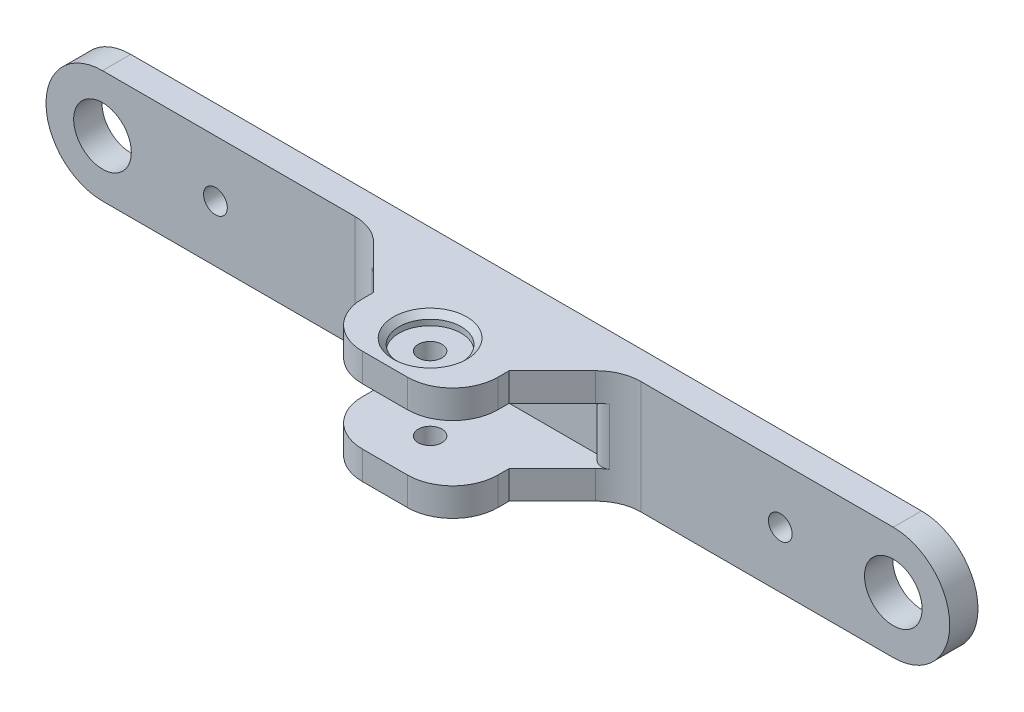
ISO-10303-21;
HEADER;
FILE_DESCRIPTION(('STEP AP214'),'2;1');
FILE_NAME('part.step','',(''),(''),'','','');
FILE_SCHEMA(('AUTOMOTIVE_DESIGN { 1 0 10303 214 1 1 1 1 }'));
ENDSEC;
DATA;
#1=APPLICATION_CONTEXT('core data for automotive mechanical design processes');
#2=APPLICATION_PROTOCOL_DEFINITION('international standard','automotive_design',2000,#1);
#3=PRODUCT_CONTEXT('',#1,'mechanical');
#4=PRODUCT('Part','Part','',(#3));
#5=PRODUCT_RELATED_PRODUCT_CATEGORY('part','',(#4));
#6=PRODUCT_DEFINITION_FORMATION('','',#4);
#7=PRODUCT_DEFINITION_CONTEXT('part definition',#1,'design');
#8=PRODUCT_DEFINITION('design','',#6,#7);
#9=PRODUCT_DEFINITION_SHAPE('','',#8);
#10=(LENGTH_UNIT() NAMED_UNIT(*) SI_UNIT(.MILLI.,.METRE.));
#11=(NAMED_UNIT(*) PLANE_ANGLE_UNIT() SI_UNIT($,.RADIAN.));
#12=(NAMED_UNIT(*) SI_UNIT($,.STERADIAN.) SOLID_ANGLE_UNIT());
#13=UNCERTAINTY_MEASURE_WITH_UNIT(LENGTH_MEASURE(1.E-05),#10,'distance_accuracy_value','');
#14=(GEOMETRIC_REPRESENTATION_CONTEXT(3) GLOBAL_UNCERTAINTY_ASSIGNED_CONTEXT((#13)) GLOBAL_UNIT_ASSIGNED_CONTEXT((#10,
#11,#12)) REPRESENTATION_CONTEXT('',''));
#15=CARTESIAN_POINT('',(0.,0.,0.));
#16=DIRECTION('',(0.,0.,1.));
#17=DIRECTION('',(1.,0.,0.));
#18=AXIS2_PLACEMENT_3D('',#15,#16,#17);
#19=CARTESIAN_POINT('',(-12.,10.,15.0000000000001));
#20=DIRECTION('',(0.707106781186551,0.,-0.707106781186544));
#21=DIRECTION('',(0.,-1.,0.));
#22=AXIS2_PLACEMENT_3D('',#19,#20,#21);
#23=PLANE('',#22);
#24=DIRECTION('',(0.,1.,0.));
#25=VECTOR('',#24,1.);
#26=CARTESIAN_POINT('',(-19.6568542494923,10.,7.34314575050765));
#27=LINE('',#26,#25);
#28=CARTESIAN_POINT('',(-19.6568542494923,10.,7.34314575050765));
#29=VERTEX_POINT('',#28);
#30=CARTESIAN_POINT('',(-19.6568542494923,5.,7.34314575050765));
#31=VERTEX_POINT('',#30);
#32=EDGE_CURVE('E254',#29,#31,#27,.F.);
#33=ORIENTED_EDGE('',*,*,#32,.T.);
#34=DIRECTION('',(0.707106781186544,0.,0.707106781186551));
#35=VECTOR('',#34,1.);
#36=CARTESIAN_POINT('',(-12.,5.,15.0000000000001));
#37=LINE('',#36,#35);
#38=CARTESIAN_POINT('',(-12.,5.,15.0000000000001));
#39=VERTEX_POINT('',#38);
#40=EDGE_CURVE('E250',#31,#39,#37,.T.);
#41=ORIENTED_EDGE('',*,*,#40,.T.);
#42=DIRECTION('',(0.,-1.,0.));
#43=VECTOR('',#42,1.);
#44=CARTESIAN_POINT('',(-12.,10.,15.0000000000001));
#45=LINE('',#44,#43);
#46=CARTESIAN_POINT('',(-12.,10.,15.0000000000001));
#47=VERTEX_POINT('',#46);
#48=EDGE_CURVE('E324',#47,#39,#45,.T.);
#49=ORIENTED_EDGE('',*,*,#48,.F.);
#50=DIRECTION('',(0.707106781186544,0.,0.707106781186551));
#51=VECTOR('',#50,1.);
#52=CARTESIAN_POINT('',(-45.9999999999997,10.,-19.));
#53=LINE('',#52,#51);
#54=EDGE_CURVE('E260',#29,#47,#53,.T.);
#55=ORIENTED_EDGE('',*,*,#54,.F.);
#56=EDGE_LOOP('',(#33,#41,#49,#55));
#57=FACE_BOUND('',#56,.T.);
#58=ADVANCED_FACE('F35',(#57),#23,.F.);
#59=CARTESIAN_POINT('',(12.,10.,15.0000000000001));
#60=DIRECTION('',(-0.707106781186551,0.,-0.707106781186544));
#61=DIRECTION('',(0.,1.,0.));
#62=AXIS2_PLACEMENT_3D('',#59,#60,#61);
#63=PLANE('',#62);
#64=DIRECTION('',(0.,-1.,0.));
#65=VECTOR('',#64,1.);
#66=CARTESIAN_POINT('',(19.6568542494923,10.,7.34314575050766));
#67=LINE('',#66,#65);
#68=CARTESIAN_POINT('',(19.6568542494923,-10.,7.34314575050765));
#69=VERTEX_POINT('',#68);
#70=CARTESIAN_POINT('',(19.6568542494923,-5.,7.34314575050766));
#71=VERTEX_POINT('',#70);
#72=EDGE_CURVE('E379',#69,#71,#67,.F.);
#73=ORIENTED_EDGE('',*,*,#72,.T.);
#74=DIRECTION('',(-0.707106781186544,0.,0.707106781186551));
#75=VECTOR('',#74,1.);
#76=CARTESIAN_POINT('',(12.,-5.,15.0000000000001));
#77=LINE('',#76,#75);
#78=CARTESIAN_POINT('',(12.,-5.,15.0000000000001));
#79=VERTEX_POINT('',#78);
#80=EDGE_CURVE('E386',#71,#79,#77,.T.);
#81=ORIENTED_EDGE('',*,*,#80,.T.);
#82=DIRECTION('',(0.,1.,0.));
#83=VECTOR('',#82,1.);
#84=CARTESIAN_POINT('',(12.,10.,15.0000000000001));
#85=LINE('',#84,#83);
#86=CARTESIAN_POINT('',(12.,-10.,15.0000000000001));
#87=VERTEX_POINT('',#86);
#88=EDGE_CURVE('E327',#87,#79,#85,.T.);
#89=ORIENTED_EDGE('',*,*,#88,.F.);
#90=DIRECTION('',(-0.707106781186544,0.,0.707106781186551));
#91=VECTOR('',#90,1.);
#92=CARTESIAN_POINT('',(-23.9999999999995,-10.,51.));
#93=LINE('',#92,#91);
#94=EDGE_CURVE('E318',#69,#87,#93,.T.);
#95=ORIENTED_EDGE('',*,*,#94,.F.);
#96=EDGE_LOOP('',(#73,#81,#89,#95));
#97=FACE_BOUND('',#96,.T.);
#98=ADVANCED_FACE('F384',(#97),#63,.F.);
#99=CARTESIAN_POINT('',(0.,-10.,17.));
#100=DIRECTION('',(0.,1.,0.));
#101=DIRECTION('',(0.,0.,1.));
#102=AXIS2_PLACEMENT_3D('',#99,#100,#101);
#103=CYLINDRICAL_SURFACE('',#102,2.1);
#104=CARTESIAN_POINT('',(0.,5.,17.));
#105=DIRECTION('',(0.,1.,0.));
#106=DIRECTION('',(0.,0.,1.));
#107=AXIS2_PLACEMENT_3D('',#104,#105,#106);
#108=CIRCLE('',#107,2.1);
#109=CARTESIAN_POINT('',(0.,5.,19.1));
#110=VERTEX_POINT('',#109);
#111=EDGE_CURVE('E310',#110,#110,#108,.T.);
#112=ORIENTED_EDGE('',*,*,#111,.F.);
#113=EDGE_LOOP('',(#112));
#114=FACE_BOUND('',#113,.T.);
#115=CARTESIAN_POINT('',(0.,8.,17.));
#116=DIRECTION('',(0.,1.,0.));
#117=DIRECTION('',(0.,0.,1.));
#118=AXIS2_PLACEMENT_3D('',#115,#116,#117);
#119=CIRCLE('',#118,2.1);
#120=CARTESIAN_POINT('',(0.,8.,19.1));
#121=VERTEX_POINT('',#120);
#122=EDGE_CURVE('E360',#121,#121,#119,.F.);
#123=ORIENTED_EDGE('',*,*,#122,.F.);
#124=EDGE_LOOP('',(#123));
#125=FACE_BOUND('',#124,.T.);
#126=ADVANCED_FACE('F486',(#114,#125),#103,.F.);
#127=CARTESIAN_POINT('',(-12.,10.,25.));
#128=DIRECTION('',(1.,0.,0.));
#129=DIRECTION('',(0.,1.,0.));
#130=AXIS2_PLACEMENT_3D('',#127,#128,#129);
#131=PLANE('',#130);
#132=DIRECTION('',(0.,0.,1.));
#133=VECTOR('',#132,1.);
#134=CARTESIAN_POINT('',(-12.,5.,25.));
#135=LINE('',#134,#133);
#136=CARTESIAN_POINT('',(-12.,5.,17.));
#137=VERTEX_POINT('',#136);
#138=EDGE_CURVE('E403',#39,#137,#135,.T.);
#139=ORIENTED_EDGE('',*,*,#138,.T.);
#140=DIRECTION('',(0.,-1.,0.));
#141=VECTOR('',#140,1.);
#142=CARTESIAN_POINT('',(-12.,10.,17.));
#143=LINE('',#142,#141);
#144=CARTESIAN_POINT('',(-12.,10.,17.));
#145=VERTEX_POINT('',#144);
#146=EDGE_CURVE('E342',#137,#145,#143,.F.);
#147=ORIENTED_EDGE('',*,*,#146,.T.);
#148=DIRECTION('',(0.,0.,-1.));
#149=VECTOR('',#148,1.);
#150=CARTESIAN_POINT('',(-12.,10.,25.));
#151=LINE('',#150,#149);
#152=EDGE_CURVE('E335',#145,#47,#151,.T.);
#153=ORIENTED_EDGE('',*,*,#152,.T.);
#154=ORIENTED_EDGE('',*,*,#48,.T.);
#155=EDGE_LOOP('',(#139,#147,#153,#154));
#156=FACE_BOUND('',#155,.T.);
#157=ADVANCED_FACE('F408',(#156),#131,.F.);
#158=CARTESIAN_POINT('',(12.,10.,25.));
#159=DIRECTION('',(-1.,0.,0.));
#160=DIRECTION('',(0.,-1.,0.));
#161=AXIS2_PLACEMENT_3D('',#158,#159,#160);
#162=PLANE('',#161);
#163=DIRECTION('',(0.,0.,-1.));
#164=VECTOR('',#163,1.);
#165=CARTESIAN_POINT('',(12.,10.,25.));
#166=LINE('',#165,#164);
#167=CARTESIAN_POINT('',(12.,10.,17.));
#168=VERTEX_POINT('',#167);
#169=CARTESIAN_POINT('',(12.,10.,15.0000000000001));
#170=VERTEX_POINT('',#169);
#171=EDGE_CURVE('E338',#168,#170,#166,.T.);
#172=ORIENTED_EDGE('',*,*,#171,.F.);
#173=DIRECTION('',(0.,1.,0.));
#174=VECTOR('',#173,1.);
#175=CARTESIAN_POINT('',(12.,5.,17.));
#176=LINE('',#175,#174);
#177=CARTESIAN_POINT('',(12.,5.,17.));
#178=VERTEX_POINT('',#177);
#179=EDGE_CURVE('E349',#168,#178,#176,.F.);
#180=ORIENTED_EDGE('',*,*,#179,.T.);
#181=DIRECTION('',(0.,0.,-1.));
#182=VECTOR('',#181,1.);
#183=CARTESIAN_POINT('',(12.,5.,25.));
#184=LINE('',#183,#182);
#185=CARTESIAN_POINT('',(12.,5.,15.0000000000001));
#186=VERTEX_POINT('',#185);
#187=EDGE_CURVE('E424',#178,#186,#184,.T.);
#188=ORIENTED_EDGE('',*,*,#187,.T.);
#189=EDGE_CURVE('E330',#186,#170,#85,.T.);
#190=ORIENTED_EDGE('',*,*,#189,.T.);
#191=EDGE_LOOP('',(#172,#180,#188,#190));
#192=FACE_BOUND('',#191,.T.);
#193=ADVANCED_FACE('F557',(#192),#162,.F.);
#194=CARTESIAN_POINT('',(0.,0.,25.));
#195=DIRECTION('',(0.,0.,1.));
#196=DIRECTION('',(1.,0.,0.));
#197=AXIS2_PLACEMENT_3D('',#194,#195,#196);
#198=PLANE('',#197);
#199=DIRECTION('',(-1.,0.,0.));
#200=VECTOR('',#199,1.);
#201=CARTESIAN_POINT('',(-12.,10.,25.));
#202=LINE('',#201,#200);
#203=CARTESIAN_POINT('',(4.,10.,25.));
#204=VERTEX_POINT('',#203);
#205=CARTESIAN_POINT('',(-4.,10.,25.));
#206=VERTEX_POINT('',#205);
#207=EDGE_CURVE('E339',#204,#206,#202,.T.);
#208=ORIENTED_EDGE('',*,*,#207,.T.);
#209=DIRECTION('',(0.,-1.,0.));
#210=VECTOR('',#209,1.);
#211=CARTESIAN_POINT('',(-4.,5.,25.));
#212=LINE('',#211,#210);
#213=CARTESIAN_POINT('',(-4.,5.,25.));
#214=VERTEX_POINT('',#213);
#215=EDGE_CURVE('E391',#206,#214,#212,.T.);
#216=ORIENTED_EDGE('',*,*,#215,.T.);
#217=DIRECTION('',(-1.,0.,0.));
#218=VECTOR('',#217,1.);
#219=CARTESIAN_POINT('',(-18.,5.,25.));
#220=LINE('',#219,#218);
#221=CARTESIAN_POINT('',(4.,5.,25.));
#222=VERTEX_POINT('',#221);
#223=EDGE_CURVE('E227',#222,#214,#220,.T.);
#224=ORIENTED_EDGE('',*,*,#223,.F.);
#225=DIRECTION('',(0.,1.,0.));
#226=VECTOR('',#225,1.);
#227=CARTESIAN_POINT('',(4.,10.,25.));
#228=LINE('',#227,#226);
#229=EDGE_CURVE('E387',#222,#204,#228,.T.);
#230=ORIENTED_EDGE('',*,*,#229,.T.);
#231=EDGE_LOOP('',(#208,#216,#224,#230));
#232=FACE_BOUND('',#231,.T.);
#233=ADVANCED_FACE('F419',(#232),#198,.T.);
#234=CARTESIAN_POINT('',(-70.,0.,5.));
#235=DIRECTION('',(0.,0.,1.));
#236=DIRECTION('',(1.,0.,0.));
#237=AXIS2_PLACEMENT_3D('',#234,#235,#236);
#238=PLANE('',#237);
#239=DIRECTION('',(1.,0.,0.));
#240=VECTOR('',#239,1.);
#241=CARTESIAN_POINT('',(-70.,-10.,5.));
#242=LINE('',#241,#240);
#243=CARTESIAN_POINT('',(-70.,-10.,5.));
#244=VERTEX_POINT('',#243);
#245=CARTESIAN_POINT('',(-25.3137084989848,-10.,5.));
#246=VERTEX_POINT('',#245);
#247=EDGE_CURVE('E277',#244,#246,#242,.T.);
#248=ORIENTED_EDGE('',*,*,#247,.T.);
#249=DIRECTION('',(0.,1.,0.));
#250=VECTOR('',#249,1.);
#251=CARTESIAN_POINT('',(-25.3137084989848,0.,5.));
#252=LINE('',#251,#250);
#253=CARTESIAN_POINT('',(-25.3137084989848,10.,5.));
#254=VERTEX_POINT('',#253);
#255=EDGE_CURVE('E267',#246,#254,#252,.T.);
#256=ORIENTED_EDGE('',*,*,#255,.T.);
#257=DIRECTION('',(-1.,0.,0.));
#258=VECTOR('',#257,1.);
#259=CARTESIAN_POINT('',(-70.,10.,5.));
#260=LINE('',#259,#258);
#261=CARTESIAN_POINT('',(-70.,10.,5.));
#262=VERTEX_POINT('',#261);
#263=EDGE_CURVE('E299',#254,#262,#260,.T.);
#264=ORIENTED_EDGE('',*,*,#263,.T.);
#265=CARTESIAN_POINT('',(-70.,0.,5.));
#266=DIRECTION('',(0.,0.,1.));
#267=DIRECTION('',(1.,0.,0.));
#268=AXIS2_PLACEMENT_3D('',#265,#266,#267);
#269=CIRCLE('',#268,10.);
#270=EDGE_CURVE('E278',#262,#244,#269,.T.);
#271=ORIENTED_EDGE('',*,*,#270,.T.);
#272=EDGE_LOOP('',(#248,#256,#264,#271));
#273=FACE_BOUND('',#272,.T.);
#274=CARTESIAN_POINT('',(-70.,0.,5.));
#275=DIRECTION('',(0.,0.,1.));
#276=DIRECTION('',(1.,0.,0.));
#277=AXIS2_PLACEMENT_3D('',#274,#275,#276);
#278=CIRCLE('',#277,5.1);
#279=CARTESIAN_POINT('',(-64.9,0.,5.));
#280=VERTEX_POINT('',#279);
#281=EDGE_CURVE('E445',#280,#280,#278,.T.);
#282=ORIENTED_EDGE('',*,*,#281,.F.);
#283=EDGE_LOOP('',(#282));
#284=FACE_BOUND('',#283,.T.);
#285=CARTESIAN_POINT('',(-50.,0.,5.));
#286=DIRECTION('',(0.,0.,1.));
#287=DIRECTION('',(1.,0.,0.));
#288=AXIS2_PLACEMENT_3D('',#285,#286,#287);
#289=CIRCLE('',#288,2.1);
#290=CARTESIAN_POINT('',(-47.9,0.,5.));
#291=VERTEX_POINT('',#290);
#292=EDGE_CURVE('E431',#291,#291,#289,.T.);
#293=ORIENTED_EDGE('',*,*,#292,.F.);
#294=EDGE_LOOP('',(#293));
#295=FACE_BOUND('',#294,.T.);
#296=ADVANCED_FACE('F455',(#273,#284,#295),#238,.T.);
#297=CARTESIAN_POINT('',(-70.,0.,5.));
#298=DIRECTION('',(0.,0.,-1.));
#299=DIRECTION('',(-1.,0.,0.));
#300=AXIS2_PLACEMENT_3D('',#297,#298,#299);
#301=CYLINDRICAL_SURFACE('',#300,10.);
#302=CARTESIAN_POINT('',(-70.,0.,0.));
#303=DIRECTION('',(0.,0.,1.));
#304=DIRECTION('',(1.,0.,0.));
#305=AXIS2_PLACEMENT_3D('',#302,#303,#304);
#306=CIRCLE('',#305,10.);
#307=CARTESIAN_POINT('',(-70.,10.,0.));
#308=VERTEX_POINT('',#307);
#309=CARTESIAN_POINT('',(-70.,-10.,0.));
#310=VERTEX_POINT('',#309);
#311=EDGE_CURVE('E303',#308,#310,#306,.T.);
#312=ORIENTED_EDGE('',*,*,#311,.T.);
#313=DIRECTION('',(0.,0.,-1.));
#314=VECTOR('',#313,1.);
#315=CARTESIAN_POINT('',(-70.,-10.,5.));
#316=LINE('',#315,#314);
#317=EDGE_CURVE('E293',#244,#310,#316,.T.);
#318=ORIENTED_EDGE('',*,*,#317,.F.);
#319=ORIENTED_EDGE('',*,*,#270,.F.);
#320=DIRECTION('',(0.,0.,-1.));
#321=VECTOR('',#320,1.);
#322=CARTESIAN_POINT('',(-70.,10.,5.));
#323=LINE('',#322,#321);
#324=EDGE_CURVE('E298',#262,#308,#323,.T.);
#325=ORIENTED_EDGE('',*,*,#324,.T.);
#326=EDGE_LOOP('',(#312,#318,#319,#325));
#327=FACE_BOUND('',#326,.T.);
#328=ADVANCED_FACE('F458',(#327),#301,.T.);
#329=CARTESIAN_POINT('',(-70.,-10.,5.));
#330=DIRECTION('',(0.,1.,0.));
#331=DIRECTION('',(0.,0.,1.));
#332=AXIS2_PLACEMENT_3D('',#329,#330,#331);
#333=PLANE('',#332);
#334=CARTESIAN_POINT('',(0.,-10.,17.));
#335=DIRECTION('',(0.,1.,0.));
#336=DIRECTION('',(0.,0.,1.));
#337=AXIS2_PLACEMENT_3D('',#334,#335,#336);
#338=CIRCLE('',#337,2.1);
#339=CARTESIAN_POINT('',(0.,-10.,19.1));
#340=VERTEX_POINT('',#339);
#341=EDGE_CURVE('E311',#340,#340,#338,.T.);
#342=ORIENTED_EDGE('',*,*,#341,.T.);
#343=EDGE_LOOP('',(#342));
#344=FACE_BOUND('',#343,.T.);
#345=DIRECTION('',(1.,0.,0.));
#346=VECTOR('',#345,1.);
#347=CARTESIAN_POINT('',(-12.,-10.,25.));
#348=LINE('',#347,#346);
#349=CARTESIAN_POINT('',(-4.,-10.,25.));
#350=VERTEX_POINT('',#349);
#351=CARTESIAN_POINT('',(4.00000000000001,-10.,25.));
#352=VERTEX_POINT('',#351);
#353=EDGE_CURVE('E421',#350,#352,#348,.T.);
#354=ORIENTED_EDGE('',*,*,#353,.F.);
#355=CARTESIAN_POINT('',(-4.,-10.,17.));
#356=DIRECTION('',(0.,1.,0.));
#357=DIRECTION('',(0.,0.,1.));
#358=AXIS2_PLACEMENT_3D('',#355,#356,#357);
#359=CIRCLE('',#358,8.);
#360=CARTESIAN_POINT('',(-12.,-10.,17.));
#361=VERTEX_POINT('',#360);
#362=EDGE_CURVE('E577',#350,#361,#359,.F.);
#363=ORIENTED_EDGE('',*,*,#362,.T.);
#364=DIRECTION('',(0.,0.,-1.));
#365=VECTOR('',#364,1.);
#366=CARTESIAN_POINT('',(-12.,-10.,25.));
#367=LINE('',#366,#365);
#368=CARTESIAN_POINT('',(-12.,-10.,15.0000000000001));
#369=VERTEX_POINT('',#368);
#370=EDGE_CURVE('E435',#361,#369,#367,.T.);
#371=ORIENTED_EDGE('',*,*,#370,.T.);
#372=DIRECTION('',(-0.707106781186544,0.,-0.707106781186551));
#373=VECTOR('',#372,1.);
#374=CARTESIAN_POINT('',(-45.9999999999997,-10.,-19.));
#375=LINE('',#374,#373);
#376=CARTESIAN_POINT('',(-19.6568542494923,-10.,7.34314575050765));
#377=VERTEX_POINT('',#376);
#378=EDGE_CURVE('E315',#369,#377,#375,.T.);
#379=ORIENTED_EDGE('',*,*,#378,.T.);
#380=CARTESIAN_POINT('',(-25.3137084989848,-10.,13.));
#381=DIRECTION('',(0.,1.,0.));
#382=DIRECTION('',(0.,0.,1.));
#383=AXIS2_PLACEMENT_3D('',#380,#381,#382);
#384=CIRCLE('',#383,8.);
#385=EDGE_CURVE('E353',#377,#246,#384,.T.);
#386=ORIENTED_EDGE('',*,*,#385,.T.);
#387=ORIENTED_EDGE('',*,*,#247,.F.);
#388=ORIENTED_EDGE('',*,*,#317,.T.);
#389=DIRECTION('',(1.,0.,0.));
#390=VECTOR('',#389,1.);
#391=CARTESIAN_POINT('',(-70.,-10.,0.));
#392=LINE('',#391,#390);
#393=CARTESIAN_POINT('',(70.,-10.,0.));
#394=VERTEX_POINT('',#393);
#395=EDGE_CURVE('E537',#310,#394,#392,.T.);
#396=ORIENTED_EDGE('',*,*,#395,.T.);
#397=DIRECTION('',(0.,0.,-1.));
#398=VECTOR('',#397,1.);
#399=CARTESIAN_POINT('',(70.,-10.,5.));
#400=LINE('',#399,#398);
#401=CARTESIAN_POINT('',(70.,-10.,5.));
#402=VERTEX_POINT('',#401);
#403=EDGE_CURVE('E551',#402,#394,#400,.T.);
#404=ORIENTED_EDGE('',*,*,#403,.F.);
#405=CARTESIAN_POINT('',(25.3137084989847,-10.,5.));
#406=VERTEX_POINT('',#405);
#407=EDGE_CURVE('E274',#406,#402,#242,.T.);
#408=ORIENTED_EDGE('',*,*,#407,.F.);
#409=CARTESIAN_POINT('',(25.3137084989847,-10.,13.));
#410=DIRECTION('',(0.,1.,0.));
#411=DIRECTION('',(0.,0.,1.));
#412=AXIS2_PLACEMENT_3D('',#409,#410,#411);
#413=CIRCLE('',#412,8.);
#414=EDGE_CURVE('E355',#406,#69,#413,.T.);
#415=ORIENTED_EDGE('',*,*,#414,.T.);
#416=ORIENTED_EDGE('',*,*,#94,.T.);
#417=DIRECTION('',(0.,0.,-1.));
#418=VECTOR('',#417,1.);
#419=CARTESIAN_POINT('',(12.,-10.,25.));
#420=LINE('',#419,#418);
#421=CARTESIAN_POINT('',(12.,-10.,17.));
#422=VERTEX_POINT('',#421);
#423=EDGE_CURVE('E279',#422,#87,#420,.T.);
#424=ORIENTED_EDGE('',*,*,#423,.F.);
#425=CARTESIAN_POINT('',(4.00000000000001,-10.,17.));
#426=DIRECTION('',(0.,1.,0.));
#427=DIRECTION('',(0.,0.,1.));
#428=AXIS2_PLACEMENT_3D('',#425,#426,#427);
#429=CIRCLE('',#428,8.);
#430=EDGE_CURVE('E273',#422,#352,#429,.F.);
#431=ORIENTED_EDGE('',*,*,#430,.T.);
#432=EDGE_LOOP('',(#354,#363,#371,#379,#386,#387,#388,#396,#404,#408,#415,#416,#424,#431));
#433=FACE_BOUND('',#432,.T.);
#434=ADVANCED_FACE('F507',(#344,#433),#333,.F.);
#435=CARTESIAN_POINT('',(70.,0.,5.));
#436=DIRECTION('',(0.,0.,-1.));
#437=DIRECTION('',(-1.,0.,0.));
#438=AXIS2_PLACEMENT_3D('',#435,#436,#437);
#439=CYLINDRICAL_SURFACE('',#438,10.);
#440=CARTESIAN_POINT('',(70.,0.,0.));
#441=DIRECTION('',(0.,0.,1.));
#442=DIRECTION('',(1.,0.,0.));
#443=AXIS2_PLACEMENT_3D('',#440,#441,#442);
#444=CIRCLE('',#443,10.);
#445=CARTESIAN_POINT('',(70.,10.,0.));
#446=VERTEX_POINT('',#445);
#447=EDGE_CURVE('E541',#394,#446,#444,.T.);
#448=ORIENTED_EDGE('',*,*,#447,.T.);
#449=DIRECTION('',(0.,0.,-1.));
#450=VECTOR('',#449,1.);
#451=CARTESIAN_POINT('',(70.,10.,5.));
#452=LINE('',#451,#450);
#453=CARTESIAN_POINT('',(70.,10.,5.));
#454=VERTEX_POINT('',#453);
#455=EDGE_CURVE('E549',#454,#446,#452,.T.);
#456=ORIENTED_EDGE('',*,*,#455,.F.);
#457=CARTESIAN_POINT('',(70.,0.,5.));
#458=DIRECTION('',(0.,0.,1.));
#459=DIRECTION('',(1.,0.,0.));
#460=AXIS2_PLACEMENT_3D('',#457,#458,#459);
#461=CIRCLE('',#460,10.);
#462=EDGE_CURVE('E286',#402,#454,#461,.T.);
#463=ORIENTED_EDGE('',*,*,#462,.F.);
#464=ORIENTED_EDGE('',*,*,#403,.T.);
#465=EDGE_LOOP('',(#448,#456,#463,#464));
#466=FACE_BOUND('',#465,.T.);
#467=ADVANCED_FACE('F511',(#466),#439,.T.);
#468=CARTESIAN_POINT('',(-70.,10.,5.));
#469=DIRECTION('',(0.,-1.,0.));
#470=DIRECTION('',(0.,0.,-1.));
#471=AXIS2_PLACEMENT_3D('',#468,#469,#470);
#472=PLANE('',#471);
#473=CARTESIAN_POINT('',(0.,10.,17.));
#474=DIRECTION('',(0.,-1.,0.));
#475=DIRECTION('',(0.,0.,-1.));
#476=AXIS2_PLACEMENT_3D('',#473,#474,#475);
#477=CIRCLE('',#476,6.50000000000003);
#478=CARTESIAN_POINT('',(0.,10.,10.5));
#479=VERTEX_POINT('',#478);
#480=EDGE_CURVE('E366',#479,#479,#477,.T.);
#481=ORIENTED_EDGE('',*,*,#480,.T.);
#482=EDGE_LOOP('',(#481));
#483=FACE_BOUND('',#482,.T.);
#484=ORIENTED_EDGE('',*,*,#152,.F.);
#485=CARTESIAN_POINT('',(-4.,10.,17.));
#486=DIRECTION('',(0.,-1.,0.));
#487=DIRECTION('',(0.,0.,-1.));
#488=AXIS2_PLACEMENT_3D('',#485,#486,#487);
#489=CIRCLE('',#488,8.);
#490=EDGE_CURVE('E347',#145,#206,#489,.F.);
#491=ORIENTED_EDGE('',*,*,#490,.T.);
#492=ORIENTED_EDGE('',*,*,#207,.F.);
#493=CARTESIAN_POINT('',(4.,10.,17.));
#494=DIRECTION('',(0.,-1.,0.));
#495=DIRECTION('',(0.,0.,-1.));
#496=AXIS2_PLACEMENT_3D('',#493,#494,#495);
#497=CIRCLE('',#496,8.);
#498=EDGE_CURVE('E344',#204,#168,#497,.F.);
#499=ORIENTED_EDGE('',*,*,#498,.T.);
#500=ORIENTED_EDGE('',*,*,#171,.T.);
#501=DIRECTION('',(0.707106781186544,0.,-0.707106781186551));
#502=VECTOR('',#501,1.);
#503=CARTESIAN_POINT('',(-23.9999999999995,10.,51.));
#504=LINE('',#503,#502);
#505=CARTESIAN_POINT('',(19.6568542494923,10.,7.34314575050765));
#506=VERTEX_POINT('',#505);
#507=EDGE_CURVE('E321',#170,#506,#504,.T.);
#508=ORIENTED_EDGE('',*,*,#507,.T.);
#509=CARTESIAN_POINT('',(25.3137084989847,10.,13.));
#510=DIRECTION('',(0.,-1.,0.));
#511=DIRECTION('',(0.,0.,-1.));
#512=AXIS2_PLACEMENT_3D('',#509,#510,#511);
#513=CIRCLE('',#512,8.);
#514=CARTESIAN_POINT('',(25.3137084989847,10.,5.));
#515=VERTEX_POINT('',#514);
#516=EDGE_CURVE('E357',#506,#515,#513,.T.);
#517=ORIENTED_EDGE('',*,*,#516,.T.);
#518=EDGE_CURVE('E295',#454,#515,#260,.T.);
#519=ORIENTED_EDGE('',*,*,#518,.F.);
#520=ORIENTED_EDGE('',*,*,#455,.T.);
#521=DIRECTION('',(-1.,0.,0.));
#522=VECTOR('',#521,1.);
#523=CARTESIAN_POINT('',(-70.,10.,0.));
#524=LINE('',#523,#522);
#525=EDGE_CURVE('E536',#446,#308,#524,.T.);
#526=ORIENTED_EDGE('',*,*,#525,.T.);
#527=ORIENTED_EDGE('',*,*,#324,.F.);
#528=ORIENTED_EDGE('',*,*,#263,.F.);
#529=CARTESIAN_POINT('',(-25.3137084989848,10.,13.));
#530=DIRECTION('',(0.,-1.,0.));
#531=DIRECTION('',(0.,0.,-1.));
#532=AXIS2_PLACEMENT_3D('',#529,#530,#531);
#533=CIRCLE('',#532,8.);
#534=EDGE_CURVE('E351',#254,#29,#533,.T.);
#535=ORIENTED_EDGE('',*,*,#534,.T.);
#536=ORIENTED_EDGE('',*,*,#54,.T.);
#537=EDGE_LOOP('',(#484,#491,#492,#499,#500,#508,#517,#519,#520,#526,#527,#528,#535,#536));
#538=FACE_BOUND('',#537,.T.);
#539=ADVANCED_FACE('F417',(#483,#538),#472,.F.);
#540=ORIENTED_EDGE('',*,*,#518,.T.);
#541=DIRECTION('',(0.,-1.,0.));
#542=VECTOR('',#541,1.);
#543=CARTESIAN_POINT('',(25.3137084989847,0.,5.));
#544=LINE('',#543,#542);
#545=EDGE_CURVE('E393',#515,#406,#544,.T.);
#546=ORIENTED_EDGE('',*,*,#545,.T.);
#547=ORIENTED_EDGE('',*,*,#407,.T.);
#548=ORIENTED_EDGE('',*,*,#462,.T.);
#549=EDGE_LOOP('',(#540,#546,#547,#548));
#550=FACE_BOUND('',#549,.T.);
#551=CARTESIAN_POINT('',(50.,0.,5.));
#552=DIRECTION('',(0.,0.,1.));
#553=DIRECTION('',(1.,0.,0.));
#554=AXIS2_PLACEMENT_3D('',#551,#552,#553);
#555=CIRCLE('',#554,2.1);
#556=CARTESIAN_POINT('',(52.1,0.,5.));
#557=VERTEX_POINT('',#556);
#558=EDGE_CURVE('E432',#557,#557,#555,.T.);
#559=ORIENTED_EDGE('',*,*,#558,.F.);
#560=EDGE_LOOP('',(#559));
#561=FACE_BOUND('',#560,.T.);
#562=CARTESIAN_POINT('',(70.,0.,5.));
#563=DIRECTION('',(0.,0.,1.));
#564=DIRECTION('',(1.,0.,0.));
#565=AXIS2_PLACEMENT_3D('',#562,#563,#564);
#566=CIRCLE('',#565,5.1);
#567=CARTESIAN_POINT('',(75.1,0.,5.));
#568=VERTEX_POINT('',#567);
#569=EDGE_CURVE('E439',#568,#568,#566,.T.);
#570=ORIENTED_EDGE('',*,*,#569,.F.);
#571=EDGE_LOOP('',(#570));
#572=FACE_BOUND('',#571,.T.);
#573=ADVANCED_FACE('F461',(#550,#561,#572),#238,.T.);
#574=CARTESIAN_POINT('',(-70.,0.,0.));
#575=DIRECTION('',(0.,0.,1.));
#576=DIRECTION('',(1.,0.,0.));
#577=AXIS2_PLACEMENT_3D('',#574,#575,#576);
#578=PLANE('',#577);
#579=CARTESIAN_POINT('',(50.,0.,0.));
#580=DIRECTION('',(0.,0.,1.));
#581=DIRECTION('',(1.,0.,0.));
#582=AXIS2_PLACEMENT_3D('',#579,#580,#581);
#583=CIRCLE('',#582,2.1);
#584=CARTESIAN_POINT('',(52.1,0.,0.));
#585=VERTEX_POINT('',#584);
#586=EDGE_CURVE('E428',#585,#585,#583,.T.);
#587=ORIENTED_EDGE('',*,*,#586,.T.);
#588=EDGE_LOOP('',(#587));
#589=FACE_BOUND('',#588,.T.);
#590=CARTESIAN_POINT('',(-50.,0.,0.));
#591=DIRECTION('',(0.,0.,1.));
#592=DIRECTION('',(1.,0.,0.));
#593=AXIS2_PLACEMENT_3D('',#590,#591,#592);
#594=CIRCLE('',#593,2.1);
#595=CARTESIAN_POINT('',(-47.9,0.,0.));
#596=VERTEX_POINT('',#595);
#597=EDGE_CURVE('E436',#596,#596,#594,.T.);
#598=ORIENTED_EDGE('',*,*,#597,.T.);
#599=EDGE_LOOP('',(#598));
#600=FACE_BOUND('',#599,.T.);
#601=CARTESIAN_POINT('',(70.,0.,0.));
#602=DIRECTION('',(0.,0.,1.));
#603=DIRECTION('',(1.,0.,0.));
#604=AXIS2_PLACEMENT_3D('',#601,#602,#603);
#605=CIRCLE('',#604,5.1);
#606=CARTESIAN_POINT('',(75.1,0.,0.));
#607=VERTEX_POINT('',#606);
#608=EDGE_CURVE('E442',#607,#607,#605,.T.);
#609=ORIENTED_EDGE('',*,*,#608,.T.);
#610=EDGE_LOOP('',(#609));
#611=FACE_BOUND('',#610,.T.);
#612=CARTESIAN_POINT('',(-70.,0.,0.));
#613=DIRECTION('',(0.,0.,1.));
#614=DIRECTION('',(1.,0.,0.));
#615=AXIS2_PLACEMENT_3D('',#612,#613,#614);
#616=CIRCLE('',#615,5.1);
#617=CARTESIAN_POINT('',(-64.9,0.,0.));
#618=VERTEX_POINT('',#617);
#619=EDGE_CURVE('E448',#618,#618,#616,.T.);
#620=ORIENTED_EDGE('',*,*,#619,.T.);
#621=EDGE_LOOP('',(#620));
#622=FACE_BOUND('',#621,.T.);
#623=ORIENTED_EDGE('',*,*,#311,.F.);
#624=ORIENTED_EDGE('',*,*,#525,.F.);
#625=ORIENTED_EDGE('',*,*,#447,.F.);
#626=ORIENTED_EDGE('',*,*,#395,.F.);
#627=EDGE_LOOP('',(#623,#624,#625,#626));
#628=FACE_BOUND('',#627,.T.);
#629=ADVANCED_FACE('F519',(#589,#600,#611,#622,#628),#578,.F.);
#630=CARTESIAN_POINT('',(-70.,0.,0.));
#631=DIRECTION('',(0.,0.,1.));
#632=DIRECTION('',(1.,0.,0.));
#633=AXIS2_PLACEMENT_3D('',#630,#631,#632);
#634=CYLINDRICAL_SURFACE('',#633,5.1);
#635=ORIENTED_EDGE('',*,*,#619,.F.);
#636=EDGE_LOOP('',(#635));
#637=FACE_BOUND('',#636,.T.);
#638=ORIENTED_EDGE('',*,*,#281,.T.);
#639=EDGE_LOOP('',(#638));
#640=FACE_BOUND('',#639,.T.);
#641=ADVANCED_FACE('F453',(#637,#640),#634,.F.);
#642=CARTESIAN_POINT('',(70.,0.,0.));
#643=DIRECTION('',(0.,0.,1.));
#644=DIRECTION('',(1.,0.,0.));
#645=AXIS2_PLACEMENT_3D('',#642,#643,#644);
#646=CYLINDRICAL_SURFACE('',#645,5.1);
#647=ORIENTED_EDGE('',*,*,#608,.F.);
#648=EDGE_LOOP('',(#647));
#649=FACE_BOUND('',#648,.T.);
#650=ORIENTED_EDGE('',*,*,#569,.T.);
#651=EDGE_LOOP('',(#650));
#652=FACE_BOUND('',#651,.T.);
#653=ADVANCED_FACE('F467',(#649,#652),#646,.F.);
#654=CARTESIAN_POINT('',(-50.,0.,0.));
#655=DIRECTION('',(0.,0.,1.));
#656=DIRECTION('',(1.,0.,0.));
#657=AXIS2_PLACEMENT_3D('',#654,#655,#656);
#658=CYLINDRICAL_SURFACE('',#657,2.1);
#659=ORIENTED_EDGE('',*,*,#597,.F.);
#660=EDGE_LOOP('',(#659));
#661=FACE_BOUND('',#660,.T.);
#662=ORIENTED_EDGE('',*,*,#292,.T.);
#663=EDGE_LOOP('',(#662));
#664=FACE_BOUND('',#663,.T.);
#665=ADVANCED_FACE('F464',(#661,#664),#658,.F.);
#666=CARTESIAN_POINT('',(50.,0.,0.));
#667=DIRECTION('',(0.,0.,1.));
#668=DIRECTION('',(1.,0.,0.));
#669=AXIS2_PLACEMENT_3D('',#666,#667,#668);
#670=CYLINDRICAL_SURFACE('',#669,2.1);
#671=ORIENTED_EDGE('',*,*,#586,.F.);
#672=EDGE_LOOP('',(#671));
#673=FACE_BOUND('',#672,.T.);
#674=ORIENTED_EDGE('',*,*,#558,.T.);
#675=EDGE_LOOP('',(#674));
#676=FACE_BOUND('',#675,.T.);
#677=ADVANCED_FACE('F466',(#673,#676),#670,.F.);
#678=ORIENTED_EDGE('',*,*,#370,.F.);
#679=DIRECTION('',(0.,-1.,0.));
#680=VECTOR('',#679,1.);
#681=CARTESIAN_POINT('',(-12.,-5.,17.));
#682=LINE('',#681,#680);
#683=CARTESIAN_POINT('',(-12.,-5.,17.));
#684=VERTEX_POINT('',#683);
#685=EDGE_CURVE('E575',#361,#684,#682,.F.);
#686=ORIENTED_EDGE('',*,*,#685,.T.);
#687=DIRECTION('',(0.,0.,-1.));
#688=VECTOR('',#687,1.);
#689=CARTESIAN_POINT('',(-12.,-5.,25.));
#690=LINE('',#689,#688);
#691=CARTESIAN_POINT('',(-12.,-5.,15.0000000000001));
#692=VERTEX_POINT('',#691);
#693=EDGE_CURVE('E596',#684,#692,#690,.T.);
#694=ORIENTED_EDGE('',*,*,#693,.T.);
#695=EDGE_CURVE('E326',#692,#369,#45,.T.);
#696=ORIENTED_EDGE('',*,*,#695,.T.);
#697=EDGE_LOOP('',(#678,#686,#694,#696));
#698=FACE_BOUND('',#697,.T.);
#699=ADVANCED_FACE('F474',(#698),#131,.F.);
#700=DIRECTION('',(0.,0.,1.));
#701=VECTOR('',#700,1.);
#702=CARTESIAN_POINT('',(12.,-5.,25.));
#703=LINE('',#702,#701);
#704=CARTESIAN_POINT('',(12.,-5.,17.));
#705=VERTEX_POINT('',#704);
#706=EDGE_CURVE('E410',#79,#705,#703,.T.);
#707=ORIENTED_EDGE('',*,*,#706,.T.);
#708=DIRECTION('',(0.,1.,0.));
#709=VECTOR('',#708,1.);
#710=CARTESIAN_POINT('',(12.,-10.,17.));
#711=LINE('',#710,#709);
#712=EDGE_CURVE('E565',#705,#422,#711,.F.);
#713=ORIENTED_EDGE('',*,*,#712,.T.);
#714=ORIENTED_EDGE('',*,*,#423,.T.);
#715=ORIENTED_EDGE('',*,*,#88,.T.);
#716=EDGE_LOOP('',(#707,#713,#714,#715));
#717=FACE_BOUND('',#716,.T.);
#718=ADVANCED_FACE('F501',(#717),#162,.F.);
#719=DIRECTION('',(1.,0.,0.));
#720=VECTOR('',#719,1.);
#721=CARTESIAN_POINT('',(-18.,-5.,25.));
#722=LINE('',#721,#720);
#723=CARTESIAN_POINT('',(-4.,-5.,25.));
#724=VERTEX_POINT('',#723);
#725=CARTESIAN_POINT('',(4.00000000000001,-5.,25.));
#726=VERTEX_POINT('',#725);
#727=EDGE_CURVE('E611',#724,#726,#722,.T.);
#728=ORIENTED_EDGE('',*,*,#727,.F.);
#729=DIRECTION('',(0.,-1.,0.));
#730=VECTOR('',#729,1.);
#731=CARTESIAN_POINT('',(-4.,-10.,25.));
#732=LINE('',#731,#730);
#733=EDGE_CURVE('E265',#724,#350,#732,.T.);
#734=ORIENTED_EDGE('',*,*,#733,.T.);
#735=ORIENTED_EDGE('',*,*,#353,.T.);
#736=DIRECTION('',(0.,1.,0.));
#737=VECTOR('',#736,1.);
#738=CARTESIAN_POINT('',(4.00000000000001,-5.,25.));
#739=LINE('',#738,#737);
#740=EDGE_CURVE('E261',#352,#726,#739,.T.);
#741=ORIENTED_EDGE('',*,*,#740,.T.);
#742=EDGE_LOOP('',(#728,#734,#735,#741));
#743=FACE_BOUND('',#742,.T.);
#744=ADVANCED_FACE('F497',(#743),#198,.T.);
#745=DIRECTION('',(0.707106781186544,0.,-0.707106781186551));
#746=VECTOR('',#745,1.);
#747=CARTESIAN_POINT('',(12.,5.,15.0000000000001));
#748=LINE('',#747,#746);
#749=CARTESIAN_POINT('',(19.6568542494923,5.,7.34314575050766));
#750=VERTEX_POINT('',#749);
#751=EDGE_CURVE('E58',#186,#750,#748,.T.);
#752=ORIENTED_EDGE('',*,*,#751,.T.);
#753=EDGE_CURVE('E388',#750,#506,#67,.F.);
#754=ORIENTED_EDGE('',*,*,#753,.T.);
#755=ORIENTED_EDGE('',*,*,#507,.F.);
#756=ORIENTED_EDGE('',*,*,#189,.F.);
#757=EDGE_LOOP('',(#752,#754,#755,#756));
#758=FACE_BOUND('',#757,.T.);
#759=ADVANCED_FACE('F488',(#758),#63,.F.);
#760=DIRECTION('',(-0.707106781186544,0.,-0.707106781186551));
#761=VECTOR('',#760,1.);
#762=CARTESIAN_POINT('',(-12.,-5.,15.0000000000001));
#763=LINE('',#762,#761);
#764=CARTESIAN_POINT('',(-19.6568542494923,-5.,7.34314575050765));
#765=VERTEX_POINT('',#764);
#766=EDGE_CURVE('E50',#692,#765,#763,.T.);
#767=ORIENTED_EDGE('',*,*,#766,.T.);
#768=EDGE_CURVE('E262',#765,#377,#27,.F.);
#769=ORIENTED_EDGE('',*,*,#768,.T.);
#770=ORIENTED_EDGE('',*,*,#378,.F.);
#771=ORIENTED_EDGE('',*,*,#695,.F.);
#772=EDGE_LOOP('',(#767,#769,#770,#771));
#773=FACE_BOUND('',#772,.T.);
#774=ADVANCED_FACE('F482',(#773),#23,.F.);
#775=CARTESIAN_POINT('',(-18.,5.,5.));
#776=DIRECTION('',(0.,1.,0.));
#777=DIRECTION('',(0.,0.,1.));
#778=AXIS2_PLACEMENT_3D('',#775,#776,#777);
#779=PLANE('',#778);
#780=ORIENTED_EDGE('',*,*,#111,.T.);
#781=EDGE_LOOP('',(#780));
#782=FACE_BOUND('',#781,.T.);
#783=ORIENTED_EDGE('',*,*,#223,.T.);
#784=CARTESIAN_POINT('',(-4.,5.,17.));
#785=DIRECTION('',(0.,1.,0.));
#786=DIRECTION('',(0.,0.,1.));
#787=AXIS2_PLACEMENT_3D('',#784,#785,#786);
#788=CIRCLE('',#787,8.);
#789=EDGE_CURVE('E340',#214,#137,#788,.F.);
#790=ORIENTED_EDGE('',*,*,#789,.T.);
#791=ORIENTED_EDGE('',*,*,#138,.F.);
#792=ORIENTED_EDGE('',*,*,#40,.F.);
#793=CARTESIAN_POINT('',(-25.3137084989848,5.,13.));
#794=DIRECTION('',(0.,1.,0.));
#795=DIRECTION('',(0.,0.,1.));
#796=AXIS2_PLACEMENT_3D('',#793,#794,#795);
#797=CIRCLE('',#796,8.);
#798=CARTESIAN_POINT('',(-21.0234689681274,5.,6.24767856453285));
#799=VERTEX_POINT('',#798);
#800=EDGE_CURVE('E235',#799,#31,#797,.F.);
#801=ORIENTED_EDGE('',*,*,#800,.F.);
#802=CARTESIAN_POINT('',(-19.9509090854131,5.,4.55959820566606));
#803=DIRECTION('',(0.,1.,0.));
#804=DIRECTION('',(0.,0.,1.));
#805=AXIS2_PLACEMENT_3D('',#802,#803,#804);
#806=CIRCLE('',#805,2.);
#807=CARTESIAN_POINT('',(-18.,5.,5.));
#808=VERTEX_POINT('',#807);
#809=EDGE_CURVE('E43',#799,#808,#806,.T.);
#810=ORIENTED_EDGE('',*,*,#809,.T.);
#811=DIRECTION('',(-1.,0.,0.));
#812=VECTOR('',#811,1.);
#813=CARTESIAN_POINT('',(-18.,5.,5.));
#814=LINE('',#813,#812);
#815=CARTESIAN_POINT('',(18.,5.,5.));
#816=VERTEX_POINT('',#815);
#817=EDGE_CURVE('E225',#816,#808,#814,.T.);
#818=ORIENTED_EDGE('',*,*,#817,.F.);
#819=CARTESIAN_POINT('',(19.9509090854131,5.,4.55959820566604));
#820=DIRECTION('',(0.,1.,0.));
#821=DIRECTION('',(0.,0.,1.));
#822=AXIS2_PLACEMENT_3D('',#819,#820,#821);
#823=CIRCLE('',#822,2.);
#824=CARTESIAN_POINT('',(21.0234689681274,5.,6.24767856453283));
#825=VERTEX_POINT('',#824);
#826=EDGE_CURVE('E244',#816,#825,#823,.T.);
#827=ORIENTED_EDGE('',*,*,#826,.T.);
#828=CARTESIAN_POINT('',(25.3137084989847,5.,13.));
#829=DIRECTION('',(0.,1.,0.));
#830=DIRECTION('',(0.,0.,1.));
#831=AXIS2_PLACEMENT_3D('',#828,#829,#830);
#832=CIRCLE('',#831,8.);
#833=EDGE_CURVE('E369',#750,#825,#832,.F.);
#834=ORIENTED_EDGE('',*,*,#833,.F.);
#835=ORIENTED_EDGE('',*,*,#751,.F.);
#836=ORIENTED_EDGE('',*,*,#187,.F.);
#837=CARTESIAN_POINT('',(4.00000000000001,5.,17.));
#838=DIRECTION('',(0.,1.,0.));
#839=DIRECTION('',(0.,0.,1.));
#840=AXIS2_PLACEMENT_3D('',#837,#838,#839);
#841=CIRCLE('',#840,8.);
#842=EDGE_CURVE('E398',#178,#222,#841,.F.);
#843=ORIENTED_EDGE('',*,*,#842,.T.);
#844=EDGE_LOOP('',(#783,#790,#791,#792,#801,#810,#818,#827,#834,#835,#836,#843));
#845=FACE_BOUND('',#844,.T.);
#846=ADVANCED_FACE('F247',(#782,#845),#779,.F.);
#847=CARTESIAN_POINT('',(-18.,-5.,5.));
#848=DIRECTION('',(0.,-1.,0.));
#849=DIRECTION('',(0.,0.,-1.));
#850=AXIS2_PLACEMENT_3D('',#847,#848,#849);
#851=PLANE('',#850);
#852=CARTESIAN_POINT('',(0.,-5.,17.));
#853=DIRECTION('',(0.,-1.,0.));
#854=DIRECTION('',(0.,0.,-1.));
#855=AXIS2_PLACEMENT_3D('',#852,#853,#854);
#856=CIRCLE('',#855,2.1);
#857=CARTESIAN_POINT('',(0.,-5.,14.9));
#858=VERTEX_POINT('',#857);
#859=EDGE_CURVE('E307',#858,#858,#856,.T.);
#860=ORIENTED_EDGE('',*,*,#859,.T.);
#861=EDGE_LOOP('',(#860));
#862=FACE_BOUND('',#861,.T.);
#863=ORIENTED_EDGE('',*,*,#693,.F.);
#864=CARTESIAN_POINT('',(-4.,-5.,17.));
#865=DIRECTION('',(0.,-1.,0.));
#866=DIRECTION('',(0.,0.,-1.));
#867=AXIS2_PLACEMENT_3D('',#864,#865,#866);
#868=CIRCLE('',#867,8.);
#869=EDGE_CURVE('E566',#684,#724,#868,.F.);
#870=ORIENTED_EDGE('',*,*,#869,.T.);
#871=ORIENTED_EDGE('',*,*,#727,.T.);
#872=CARTESIAN_POINT('',(4.00000000000001,-5.,17.));
#873=DIRECTION('',(0.,-1.,0.));
#874=DIRECTION('',(0.,0.,-1.));
#875=AXIS2_PLACEMENT_3D('',#872,#873,#874);
#876=CIRCLE('',#875,8.);
#877=EDGE_CURVE('E571',#726,#705,#876,.F.);
#878=ORIENTED_EDGE('',*,*,#877,.T.);
#879=ORIENTED_EDGE('',*,*,#706,.F.);
#880=ORIENTED_EDGE('',*,*,#80,.F.);
#881=CARTESIAN_POINT('',(25.3137084989847,-5.,13.));
#882=DIRECTION('',(0.,-1.,0.));
#883=DIRECTION('',(0.,0.,-1.));
#884=AXIS2_PLACEMENT_3D('',#881,#882,#883);
#885=CIRCLE('',#884,8.);
#886=CARTESIAN_POINT('',(21.0234689681274,-5.,6.24767856453283));
#887=VERTEX_POINT('',#886);
#888=EDGE_CURVE('E239',#887,#71,#885,.F.);
#889=ORIENTED_EDGE('',*,*,#888,.F.);
#890=CARTESIAN_POINT('',(19.9509090854131,-5.,4.55959820566604));
#891=DIRECTION('',(0.,-1.,0.));
#892=DIRECTION('',(0.,0.,-1.));
#893=AXIS2_PLACEMENT_3D('',#890,#891,#892);
#894=CIRCLE('',#893,2.);
#895=CARTESIAN_POINT('',(18.,-5.,5.));
#896=VERTEX_POINT('',#895);
#897=EDGE_CURVE('E215',#887,#896,#894,.T.);
#898=ORIENTED_EDGE('',*,*,#897,.T.);
#899=DIRECTION('',(1.,0.,0.));
#900=VECTOR('',#899,1.);
#901=CARTESIAN_POINT('',(-18.,-5.,5.));
#902=LINE('',#901,#900);
#903=CARTESIAN_POINT('',(-18.,-5.,5.));
#904=VERTEX_POINT('',#903);
#905=EDGE_CURVE('E208',#904,#896,#902,.T.);
#906=ORIENTED_EDGE('',*,*,#905,.F.);
#907=CARTESIAN_POINT('',(-19.9509090854131,-5.,4.55959820566606));
#908=DIRECTION('',(0.,-1.,0.));
#909=DIRECTION('',(0.,0.,-1.));
#910=AXIS2_PLACEMENT_3D('',#907,#908,#909);
#911=CIRCLE('',#910,2.);
#912=CARTESIAN_POINT('',(-21.0234689681274,-5.,6.24767856453285));
#913=VERTEX_POINT('',#912);
#914=EDGE_CURVE('E11',#904,#913,#911,.T.);
#915=ORIENTED_EDGE('',*,*,#914,.T.);
#916=CARTESIAN_POINT('',(-25.3137084989848,-5.,13.));
#917=DIRECTION('',(0.,-1.,0.));
#918=DIRECTION('',(0.,0.,-1.));
#919=AXIS2_PLACEMENT_3D('',#916,#917,#918);
#920=CIRCLE('',#919,8.);
#921=EDGE_CURVE('E236',#765,#913,#920,.F.);
#922=ORIENTED_EDGE('',*,*,#921,.F.);
#923=ORIENTED_EDGE('',*,*,#766,.F.);
#924=EDGE_LOOP('',(#863,#870,#871,#878,#879,#880,#889,#898,#906,#915,#922,#923));
#925=FACE_BOUND('',#924,.T.);
#926=ADVANCED_FACE('F211',(#862,#925),#851,.F.);
#927=CARTESIAN_POINT('',(0.,0.,5.));
#928=DIRECTION('',(0.,0.,1.));
#929=DIRECTION('',(1.,0.,0.));
#930=AXIS2_PLACEMENT_3D('',#927,#928,#929);
#931=PLANE('',#930);
#932=DIRECTION('',(0.,-1.,0.));
#933=VECTOR('',#932,1.);
#934=CARTESIAN_POINT('',(-18.,5.,5.));
#935=LINE('',#934,#933);
#936=EDGE_CURVE('E219',#808,#904,#935,.T.);
#937=ORIENTED_EDGE('',*,*,#936,.T.);
#938=ORIENTED_EDGE('',*,*,#905,.T.);
#939=DIRECTION('',(0.,1.,0.));
#940=VECTOR('',#939,1.);
#941=CARTESIAN_POINT('',(18.,5.,5.));
#942=LINE('',#941,#940);
#943=EDGE_CURVE('E218',#896,#816,#942,.T.);
#944=ORIENTED_EDGE('',*,*,#943,.T.);
#945=ORIENTED_EDGE('',*,*,#817,.T.);
#946=EDGE_LOOP('',(#937,#938,#944,#945));
#947=FACE_BOUND('',#946,.T.);
#948=ADVANCED_FACE('F223',(#947),#931,.T.);
#949=ORIENTED_EDGE('',*,*,#341,.F.);
#950=EDGE_LOOP('',(#949));
#951=FACE_BOUND('',#950,.T.);
#952=ORIENTED_EDGE('',*,*,#859,.F.);
#953=EDGE_LOOP('',(#952));
#954=FACE_BOUND('',#953,.T.);
#955=ADVANCED_FACE('F644',(#951,#954),#103,.F.);
#956=CARTESIAN_POINT('',(-25.3137084989848,0.,13.));
#957=DIRECTION('',(0.,1.,0.));
#958=DIRECTION('',(-1.,0.,0.));
#959=AXIS2_PLACEMENT_3D('',#956,#957,#958);
#960=CYLINDRICAL_SURFACE('',#959,8.);
#961=DIRECTION('',(0.,1.,0.));
#962=VECTOR('',#961,1.);
#963=CARTESIAN_POINT('',(-21.0234689681274,0.,6.24767856453285));
#964=LINE('',#963,#962);
#965=EDGE_CURVE('E231',#913,#799,#964,.T.);
#966=ORIENTED_EDGE('',*,*,#965,.T.);
#967=ORIENTED_EDGE('',*,*,#800,.T.);
#968=ORIENTED_EDGE('',*,*,#32,.F.);
#969=ORIENTED_EDGE('',*,*,#534,.F.);
#970=ORIENTED_EDGE('',*,*,#255,.F.);
#971=ORIENTED_EDGE('',*,*,#385,.F.);
#972=ORIENTED_EDGE('',*,*,#768,.F.);
#973=ORIENTED_EDGE('',*,*,#921,.T.);
#974=EDGE_LOOP('',(#966,#967,#968,#969,#970,#971,#972,#973));
#975=FACE_BOUND('',#974,.T.);
#976=ADVANCED_FACE('F253',(#975),#960,.F.);
#977=CARTESIAN_POINT('',(-4.,0.,17.));
#978=DIRECTION('',(0.,1.,0.));
#979=DIRECTION('',(-1.,0.,0.));
#980=AXIS2_PLACEMENT_3D('',#977,#978,#979);
#981=CYLINDRICAL_SURFACE('',#980,8.);
#982=ORIENTED_EDGE('',*,*,#869,.F.);
#983=ORIENTED_EDGE('',*,*,#685,.F.);
#984=ORIENTED_EDGE('',*,*,#362,.F.);
#985=ORIENTED_EDGE('',*,*,#733,.F.);
#986=EDGE_LOOP('',(#982,#983,#984,#985));
#987=FACE_BOUND('',#986,.T.);
#988=ADVANCED_FACE('F613',(#987),#981,.T.);
#989=CARTESIAN_POINT('',(4.00000000000001,0.,17.));
#990=DIRECTION('',(0.,-1.,0.));
#991=DIRECTION('',(1.,0.,0.));
#992=AXIS2_PLACEMENT_3D('',#989,#990,#991);
#993=CYLINDRICAL_SURFACE('',#992,8.);
#994=ORIENTED_EDGE('',*,*,#430,.F.);
#995=ORIENTED_EDGE('',*,*,#712,.F.);
#996=ORIENTED_EDGE('',*,*,#877,.F.);
#997=ORIENTED_EDGE('',*,*,#740,.F.);
#998=EDGE_LOOP('',(#994,#995,#996,#997));
#999=FACE_BOUND('',#998,.T.);
#1000=ADVANCED_FACE('F606',(#999),#993,.T.);
#1001=CARTESIAN_POINT('',(25.3137084989847,0.,13.));
#1002=DIRECTION('',(0.,-1.,0.));
#1003=DIRECTION('',(1.,0.,0.));
#1004=AXIS2_PLACEMENT_3D('',#1001,#1002,#1003);
#1005=CYLINDRICAL_SURFACE('',#1004,8.);
#1006=DIRECTION('',(0.,-1.,0.));
#1007=VECTOR('',#1006,1.);
#1008=CARTESIAN_POINT('',(21.0234689681274,0.,6.24767856453283));
#1009=LINE('',#1008,#1007);
#1010=EDGE_CURVE('E372',#825,#887,#1009,.T.);
#1011=ORIENTED_EDGE('',*,*,#1010,.T.);
#1012=ORIENTED_EDGE('',*,*,#888,.T.);
#1013=ORIENTED_EDGE('',*,*,#72,.F.);
#1014=ORIENTED_EDGE('',*,*,#414,.F.);
#1015=ORIENTED_EDGE('',*,*,#545,.F.);
#1016=ORIENTED_EDGE('',*,*,#516,.F.);
#1017=ORIENTED_EDGE('',*,*,#753,.F.);
#1018=ORIENTED_EDGE('',*,*,#833,.T.);
#1019=EDGE_LOOP('',(#1011,#1012,#1013,#1014,#1015,#1016,#1017,#1018));
#1020=FACE_BOUND('',#1019,.T.);
#1021=ADVANCED_FACE('F378',(#1020),#1005,.F.);
#1022=CARTESIAN_POINT('',(-4.,0.,17.));
#1023=DIRECTION('',(0.,1.,0.));
#1024=DIRECTION('',(-1.,0.,0.));
#1025=AXIS2_PLACEMENT_3D('',#1022,#1023,#1024);
#1026=CYLINDRICAL_SURFACE('',#1025,8.);
#1027=ORIENTED_EDGE('',*,*,#490,.F.);
#1028=ORIENTED_EDGE('',*,*,#146,.F.);
#1029=ORIENTED_EDGE('',*,*,#789,.F.);
#1030=ORIENTED_EDGE('',*,*,#215,.F.);
#1031=EDGE_LOOP('',(#1027,#1028,#1029,#1030));
#1032=FACE_BOUND('',#1031,.T.);
#1033=ADVANCED_FACE('F413',(#1032),#1026,.T.);
#1034=CARTESIAN_POINT('',(4.00000000000001,0.,17.));
#1035=DIRECTION('',(0.,-1.,0.));
#1036=DIRECTION('',(1.,0.,0.));
#1037=AXIS2_PLACEMENT_3D('',#1034,#1035,#1036);
#1038=CYLINDRICAL_SURFACE('',#1037,8.);
#1039=ORIENTED_EDGE('',*,*,#842,.F.);
#1040=ORIENTED_EDGE('',*,*,#179,.F.);
#1041=ORIENTED_EDGE('',*,*,#498,.F.);
#1042=ORIENTED_EDGE('',*,*,#229,.F.);
#1043=EDGE_LOOP('',(#1039,#1040,#1041,#1042));
#1044=FACE_BOUND('',#1043,.T.);
#1045=ADVANCED_FACE('F638',(#1044),#1038,.T.);
#1046=CARTESIAN_POINT('',(0.,8.,17.));
#1047=DIRECTION('',(0.,1.,0.));
#1048=DIRECTION('',(0.,0.,1.));
#1049=AXIS2_PLACEMENT_3D('',#1046,#1047,#1048);
#1050=PLANE('',#1049);
#1051=CARTESIAN_POINT('',(0.,8.,17.));
#1052=DIRECTION('',(0.,1.,0.));
#1053=DIRECTION('',(0.,0.,1.));
#1054=AXIS2_PLACEMENT_3D('',#1051,#1052,#1053);
#1055=CIRCLE('',#1054,5.5);
#1056=CARTESIAN_POINT('',(0.,8.,22.5));
#1057=VERTEX_POINT('',#1056);
#1058=EDGE_CURVE('E363',#1057,#1057,#1055,.T.);
#1059=ORIENTED_EDGE('',*,*,#1058,.T.);
#1060=EDGE_LOOP('',(#1059));
#1061=FACE_BOUND('',#1060,.T.);
#1062=ORIENTED_EDGE('',*,*,#122,.T.);
#1063=EDGE_LOOP('',(#1062));
#1064=FACE_BOUND('',#1063,.T.);
#1065=ADVANCED_FACE('F623',(#1061,#1064),#1050,.T.);
#1066=CARTESIAN_POINT('',(0.,8.,17.));
#1067=DIRECTION('',(0.,1.,0.));
#1068=DIRECTION('',(0.,0.,1.));
#1069=AXIS2_PLACEMENT_3D('',#1066,#1067,#1068);
#1070=CYLINDRICAL_SURFACE('',#1069,5.5);
#1071=CARTESIAN_POINT('',(0.,8.99999999999998,17.));
#1072=DIRECTION('',(0.,-1.,0.));
#1073=DIRECTION('',(0.,0.,-1.));
#1074=AXIS2_PLACEMENT_3D('',#1071,#1072,#1073);
#1075=CIRCLE('',#1074,5.5);
#1076=CARTESIAN_POINT('',(0.,8.99999999999998,11.5));
#1077=VERTEX_POINT('',#1076);
#1078=EDGE_CURVE('E359',#1077,#1077,#1075,.F.);
#1079=ORIENTED_EDGE('',*,*,#1078,.T.);
#1080=EDGE_LOOP('',(#1079));
#1081=FACE_BOUND('',#1080,.T.);
#1082=ORIENTED_EDGE('',*,*,#1058,.F.);
#1083=EDGE_LOOP('',(#1082));
#1084=FACE_BOUND('',#1083,.T.);
#1085=ADVANCED_FACE('F626',(#1081,#1084),#1070,.F.);
#1086=CARTESIAN_POINT('',(0.,8.99999999999998,17.));
#1087=DIRECTION('',(0.,1.,0.));
#1088=DIRECTION('',(0.,0.,1.));
#1089=AXIS2_PLACEMENT_3D('',#1086,#1087,#1088);
#1090=CONICAL_SURFACE('',#1089,5.5,0.785398163397453);
#1091=ORIENTED_EDGE('',*,*,#480,.F.);
#1092=EDGE_LOOP('',(#1091));
#1093=FACE_BOUND('',#1092,.T.);
#1094=ORIENTED_EDGE('',*,*,#1078,.F.);
#1095=EDGE_LOOP('',(#1094));
#1096=FACE_BOUND('',#1095,.T.);
#1097=ADVANCED_FACE('F628',(#1093,#1096),#1090,.F.);
#1098=CARTESIAN_POINT('',(19.9509090854131,5.,4.55959820566604));
#1099=DIRECTION('',(0.,-1.,0.));
#1100=DIRECTION('',(1.,0.,0.));
#1101=AXIS2_PLACEMENT_3D('',#1098,#1099,#1100);
#1102=CYLINDRICAL_SURFACE('',#1101,2.);
#1103=ORIENTED_EDGE('',*,*,#826,.F.);
#1104=ORIENTED_EDGE('',*,*,#943,.F.);
#1105=ORIENTED_EDGE('',*,*,#897,.F.);
#1106=ORIENTED_EDGE('',*,*,#1010,.F.);
#1107=EDGE_LOOP('',(#1103,#1104,#1105,#1106));
#1108=FACE_BOUND('',#1107,.T.);
#1109=ADVANCED_FACE('F635',(#1108),#1102,.T.);
#1110=CARTESIAN_POINT('',(-19.9509090854131,5.,4.55959820566606));
#1111=DIRECTION('',(0.,1.,0.));
#1112=DIRECTION('',(-1.,0.,0.));
#1113=AXIS2_PLACEMENT_3D('',#1110,#1111,#1112);
#1114=CYLINDRICAL_SURFACE('',#1113,2.);
#1115=ORIENTED_EDGE('',*,*,#914,.F.);
#1116=ORIENTED_EDGE('',*,*,#936,.F.);
#1117=ORIENTED_EDGE('',*,*,#809,.F.);
#1118=ORIENTED_EDGE('',*,*,#965,.F.);
#1119=EDGE_LOOP('',(#1115,#1116,#1117,#1118));
#1120=FACE_BOUND('',#1119,.T.);
#1121=ADVANCED_FACE('F37',(#1120),#1114,.T.);
#1122=CLOSED_SHELL('',(#58,#98,#126,#157,#193,#233,#296,#328,#434,#467,#539,#573,#629,#641,#653,
#665,#677,#699,#718,#744,#759,#774,#846,#926,#948,#955,#976,#988,#1000,#1021,#1033,#1045,#1065,
#1085,#1097,#1109,#1121));
#1123=MANIFOLD_SOLID_BREP('B2',#1122);
#1124=ADVANCED_BREP_SHAPE_REPRESENTATION('',(#18,#1123),#14);
#1125=SHAPE_DEFINITION_REPRESENTATION(#9,#1124);
ENDSEC;
END-ISO-10303-21;
